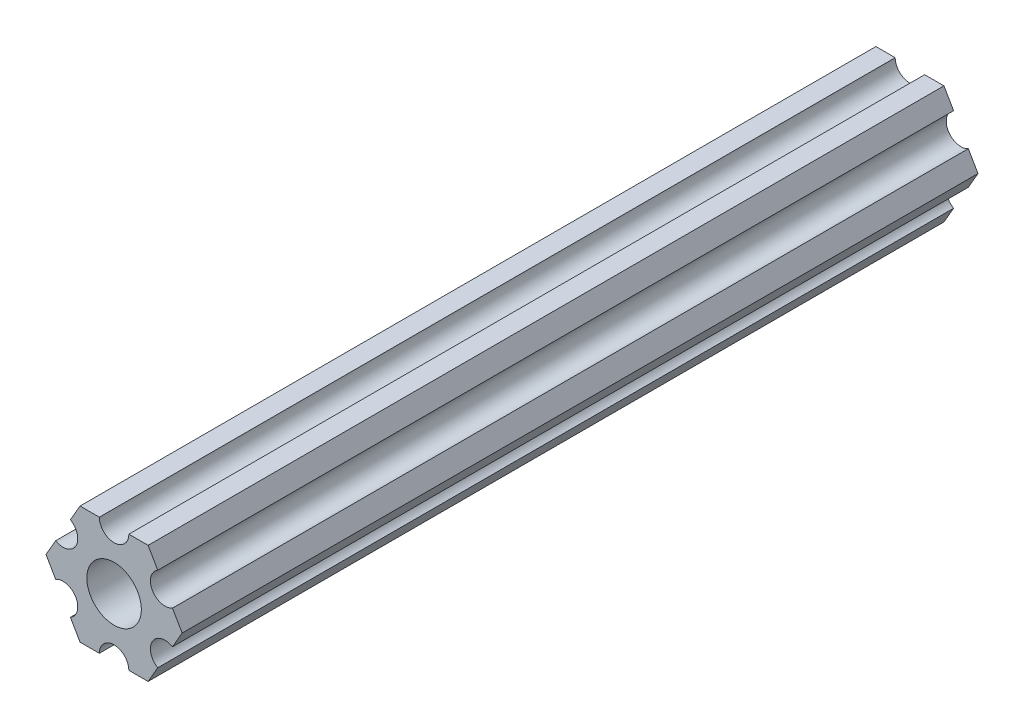
ISO-10303-21;
HEADER;
FILE_DESCRIPTION(('STEP AP214'),'2;1');
FILE_NAME('part.step','',(''),(''),'','','');
FILE_SCHEMA(('AUTOMOTIVE_DESIGN { 1 0 10303 214 1 1 1 1 }'));
ENDSEC;
DATA;
#1=APPLICATION_CONTEXT('core data for automotive mechanical design processes');
#2=APPLICATION_PROTOCOL_DEFINITION('international standard','automotive_design',2000,#1);
#3=PRODUCT_CONTEXT('',#1,'mechanical');
#4=PRODUCT('Part','Part','',(#3));
#5=PRODUCT_RELATED_PRODUCT_CATEGORY('part','',(#4));
#6=PRODUCT_DEFINITION_FORMATION('','',#4);
#7=PRODUCT_DEFINITION_CONTEXT('part definition',#1,'design');
#8=PRODUCT_DEFINITION('design','',#6,#7);
#9=PRODUCT_DEFINITION_SHAPE('','',#8);
#10=(LENGTH_UNIT() NAMED_UNIT(*) SI_UNIT(.MILLI.,.METRE.));
#11=(NAMED_UNIT(*) PLANE_ANGLE_UNIT() SI_UNIT($,.RADIAN.));
#12=(NAMED_UNIT(*) SI_UNIT($,.STERADIAN.) SOLID_ANGLE_UNIT());
#13=UNCERTAINTY_MEASURE_WITH_UNIT(LENGTH_MEASURE(1.E-05),#10,'distance_accuracy_value','');
#14=(GEOMETRIC_REPRESENTATION_CONTEXT(3) GLOBAL_UNCERTAINTY_ASSIGNED_CONTEXT((#13)) GLOBAL_UNIT_ASSIGNED_CONTEXT((#10,
#11,#12)) REPRESENTATION_CONTEXT('',''));
#15=CARTESIAN_POINT('',(0.,0.,0.));
#16=DIRECTION('',(0.,0.,1.));
#17=DIRECTION('',(1.,0.,0.));
#18=AXIS2_PLACEMENT_3D('',#15,#16,#17);
#19=CARTESIAN_POINT('',(6.29301142309098,-1.80018429024546,85.725));
#20=DIRECTION('',(-0.866025434075723,0.499999947533953,0.));
#21=DIRECTION('',(-0.499999947533953,-0.866025434075723,0.));
#22=AXIS2_PLACEMENT_3D('',#19,#20,#21);
#23=PLANE('',#22);
#24=DIRECTION('',(0.,0.,1.));
#25=VECTOR('',#24,1.);
#26=CARTESIAN_POINT('',(7.33234841870826,4.44212519169686E-07,85.725));
#27=LINE('',#26,#25);
#28=CARTESIAN_POINT('',(7.33234841870826,4.44212518961143E-07,0.));
#29=VERTEX_POINT('',#28);
#30=CARTESIAN_POINT('',(7.33234841870826,4.44212519315656E-07,85.725));
#31=VERTEX_POINT('',#30);
#32=EDGE_CURVE('E249',#29,#31,#27,.T.);
#33=ORIENTED_EDGE('',*,*,#32,.T.);
#34=DIRECTION('',(0.499999947533953,0.866025434075723,0.));
#35=VECTOR('',#34,1.);
#36=CARTESIAN_POINT('',(6.29301142309098,-1.80018429024546,85.725));
#37=LINE('',#36,#35);
#38=CARTESIAN_POINT('',(6.29301142309098,-1.80018429024546,85.725));
#39=VERTEX_POINT('',#38);
#40=EDGE_CURVE('E170',#39,#31,#37,.T.);
#41=ORIENTED_EDGE('',*,*,#40,.F.);
#42=DIRECTION('',(0.,0.,-1.));
#43=VECTOR('',#42,1.);
#44=CARTESIAN_POINT('',(6.29301142309098,-1.80018429024546,85.725));
#45=LINE('',#44,#43);
#46=CARTESIAN_POINT('',(6.29301142309098,-1.80018429024546,0.));
#47=VERTEX_POINT('',#46);
#48=EDGE_CURVE('E210',#39,#47,#45,.T.);
#49=ORIENTED_EDGE('',*,*,#48,.T.);
#50=DIRECTION('',(0.499999947533953,0.866025434075723,0.));
#51=VECTOR('',#50,1.);
#52=CARTESIAN_POINT('',(6.29301142309098,-1.80018429024546,0.));
#53=LINE('',#52,#51);
#54=EDGE_CURVE('E172',#47,#29,#53,.T.);
#55=ORIENTED_EDGE('',*,*,#54,.T.);
#56=EDGE_LOOP('',(#33,#41,#49,#55));
#57=FACE_BOUND('',#56,.T.);
#58=ADVANCED_FACE('F14',(#57),#23,.F.);
#59=CARTESIAN_POINT('',(7.33234841870826,4.44212519169686E-07,85.725));
#60=DIRECTION('',(-0.866025373493145,-0.500000052466056,0.));
#61=DIRECTION('',(0.500000052466056,-0.866025373493145,0.));
#62=AXIS2_PLACEMENT_3D('',#59,#60,#61);
#63=PLANE('',#62);
#64=DIRECTION('',(0.,0.,-1.));
#65=VECTOR('',#64,1.);
#66=CARTESIAN_POINT('',(6.29301120497139,1.80018505273895,85.725));
#67=LINE('',#66,#65);
#68=CARTESIAN_POINT('',(6.29301120497139,1.80018505273895,0.));
#69=VERTEX_POINT('',#68);
#70=CARTESIAN_POINT('',(6.29301120497139,1.80018505273895,85.725));
#71=VERTEX_POINT('',#70);
#72=EDGE_CURVE('E247',#69,#71,#67,.F.);
#73=ORIENTED_EDGE('',*,*,#72,.T.);
#74=DIRECTION('',(-0.500000052466056,0.866025373493145,0.));
#75=VECTOR('',#74,1.);
#76=CARTESIAN_POINT('',(7.33234841870826,4.44212519198905E-07,85.725));
#77=LINE('',#76,#75);
#78=EDGE_CURVE('E61',#31,#71,#77,.T.);
#79=ORIENTED_EDGE('',*,*,#78,.F.);
#80=ORIENTED_EDGE('',*,*,#32,.F.);
#81=DIRECTION('',(-0.500000052466056,0.866025373493145,0.));
#82=VECTOR('',#81,1.);
#83=CARTESIAN_POINT('',(7.33234841870826,4.44212519198905E-07,0.));
#84=LINE('',#83,#82);
#85=EDGE_CURVE('E207',#29,#69,#84,.T.);
#86=ORIENTED_EDGE('',*,*,#85,.T.);
#87=EDGE_LOOP('',(#73,#79,#80,#86));
#88=FACE_BOUND('',#87,.T.);
#89=ADVANCED_FACE('F294',(#88),#63,.F.);
#90=CARTESIAN_POINT('',(5.49926112168156,3.17500033315933,85.725));
#91=DIRECTION('',(0.,0.,-1.));
#92=DIRECTION('',(-1.,0.,0.));
#93=AXIS2_PLACEMENT_3D('',#90,#91,#92);
#94=CYLINDRICAL_SURFACE('',#93,1.5875);
#95=CARTESIAN_POINT('',(5.49926112168156,3.17500033315933,85.725));
#96=DIRECTION('',(0.,0.,-1.));
#97=DIRECTION('',(-1.,0.,0.));
#98=AXIS2_PLACEMENT_3D('',#95,#96,#97);
#99=CIRCLE('',#98,1.5875);
#100=CARTESIAN_POINT('',(4.70551103839172,4.54981561357972,85.725));
#101=VERTEX_POINT('',#100);
#102=EDGE_CURVE('E53',#71,#101,#99,.T.);
#103=ORIENTED_EDGE('',*,*,#102,.F.);
#104=ORIENTED_EDGE('',*,*,#72,.F.);
#105=CARTESIAN_POINT('',(5.49926112168156,3.17500033315933,0.));
#106=DIRECTION('',(0.,0.,-1.));
#107=DIRECTION('',(-1.,0.,0.));
#108=AXIS2_PLACEMENT_3D('',#105,#106,#107);
#109=CIRCLE('',#108,1.5875);
#110=CARTESIAN_POINT('',(4.70551103839172,4.54981561357972,0.));
#111=VERTEX_POINT('',#110);
#112=EDGE_CURVE('E17',#69,#111,#109,.T.);
#113=ORIENTED_EDGE('',*,*,#112,.T.);
#114=DIRECTION('',(0.,0.,1.));
#115=VECTOR('',#114,1.);
#116=CARTESIAN_POINT('',(4.70551103839172,4.54981561357972,85.725));
#117=LINE('',#116,#115);
#118=EDGE_CURVE('E245',#111,#101,#117,.T.);
#119=ORIENTED_EDGE('',*,*,#118,.T.);
#120=EDGE_LOOP('',(#103,#104,#113,#119));
#121=FACE_BOUND('',#120,.T.);
#122=ADVANCED_FACE('F292',(#121),#94,.F.);
#123=CARTESIAN_POINT('',(4.70551103839172,4.54981561357972,85.725));
#124=DIRECTION('',(-0.866025373493151,-0.500000052466046,0.));
#125=DIRECTION('',(0.500000052466046,-0.866025373493151,0.));
#126=AXIS2_PLACEMENT_3D('',#123,#124,#125);
#127=PLANE('',#126);
#128=DIRECTION('',(0.,0.,1.));
#129=VECTOR('',#128,1.);
#130=CARTESIAN_POINT('',(3.66617382465481,6.35000022210627,85.725));
#131=LINE('',#130,#129);
#132=CARTESIAN_POINT('',(3.66617382465481,6.35000022210627,0.));
#133=VERTEX_POINT('',#132);
#134=CARTESIAN_POINT('',(3.66617382465481,6.35000022210627,85.725));
#135=VERTEX_POINT('',#134);
#136=EDGE_CURVE('E242',#133,#135,#131,.T.);
#137=ORIENTED_EDGE('',*,*,#136,.T.);
#138=DIRECTION('',(-0.500000052466046,0.866025373493151,0.));
#139=VECTOR('',#138,1.);
#140=CARTESIAN_POINT('',(4.70551103839172,4.54981561357972,85.725));
#141=LINE('',#140,#139);
#142=EDGE_CURVE('E167',#101,#135,#141,.T.);
#143=ORIENTED_EDGE('',*,*,#142,.F.);
#144=ORIENTED_EDGE('',*,*,#118,.F.);
#145=DIRECTION('',(-0.500000052466046,0.866025373493151,0.));
#146=VECTOR('',#145,1.);
#147=CARTESIAN_POINT('',(4.70551103839172,4.54981561357972,0.));
#148=LINE('',#147,#146);
#149=EDGE_CURVE('E204',#111,#133,#148,.T.);
#150=ORIENTED_EDGE('',*,*,#149,.T.);
#151=EDGE_LOOP('',(#137,#143,#144,#150));
#152=FACE_BOUND('',#151,.T.);
#153=ADVANCED_FACE('F285',(#152),#127,.F.);
#154=CARTESIAN_POINT('',(3.66617382465481,6.35000022210627,85.725));
#155=DIRECTION('',(6.05825850611185E-08,-0.999999999999998,0.));
#156=DIRECTION('',(0.999999999999998,6.05825850611185E-08,0.));
#157=AXIS2_PLACEMENT_3D('',#154,#155,#156);
#158=PLANE('',#157);
#159=DIRECTION('',(0.,0.,-1.));
#160=VECTOR('',#159,1.);
#161=CARTESIAN_POINT('',(1.58749961530074,6.35000009617482,85.725));
#162=LINE('',#161,#160);
#163=CARTESIAN_POINT('',(1.58749961530073,6.35000015914054,0.));
#164=VERTEX_POINT('',#163);
#165=CARTESIAN_POINT('',(1.58749961530073,6.35000015914054,85.725));
#166=VERTEX_POINT('',#165);
#167=EDGE_CURVE('E240',#164,#166,#162,.F.);
#168=ORIENTED_EDGE('',*,*,#167,.T.);
#169=DIRECTION('',(1.,0.,0.));
#170=VECTOR('',#169,1.);
#171=CARTESIAN_POINT('',(5.49926112168156,6.35000022210627,85.725));
#172=LINE('',#171,#170);
#173=EDGE_CURVE('E142',#135,#166,#172,.F.);
#174=ORIENTED_EDGE('',*,*,#173,.F.);
#175=ORIENTED_EDGE('',*,*,#136,.F.);
#176=DIRECTION('',(1.,0.,0.));
#177=VECTOR('',#176,1.);
#178=CARTESIAN_POINT('',(5.49926112168156,6.35000022210627,0.));
#179=LINE('',#178,#177);
#180=EDGE_CURVE('E201',#133,#164,#179,.F.);
#181=ORIENTED_EDGE('',*,*,#180,.T.);
#182=EDGE_LOOP('',(#168,#174,#175,#181));
#183=FACE_BOUND('',#182,.T.);
#184=ADVANCED_FACE('F282',(#183),#158,.F.);
#185=CARTESIAN_POINT('',(-3.84699260060323E-07,6.35,85.725));
#186=DIRECTION('',(0.,0.,-1.));
#187=DIRECTION('',(-1.,0.,0.));
#188=AXIS2_PLACEMENT_3D('',#185,#186,#187);
#189=CYLINDRICAL_SURFACE('',#188,1.5875);
#190=DIRECTION('',(0.,0.,1.));
#191=VECTOR('',#190,1.);
#192=CARTESIAN_POINT('',(-1.58750038469926,6.34999990382518,85.725));
#193=LINE('',#192,#191);
#194=CARTESIAN_POINT('',(-1.58750038469926,6.34999990382518,0.));
#195=VERTEX_POINT('',#194);
#196=CARTESIAN_POINT('',(-1.58750038469926,6.34999990382518,85.725));
#197=VERTEX_POINT('',#196);
#198=EDGE_CURVE('E101',#195,#197,#193,.T.);
#199=ORIENTED_EDGE('',*,*,#198,.T.);
#200=CARTESIAN_POINT('',(-3.84699260060323E-07,6.35,85.725));
#201=DIRECTION('',(0.,0.,-1.));
#202=DIRECTION('',(-1.,0.,0.));
#203=AXIS2_PLACEMENT_3D('',#200,#201,#202);
#204=CIRCLE('',#203,1.5875);
#205=EDGE_CURVE('E146',#166,#197,#204,.T.);
#206=ORIENTED_EDGE('',*,*,#205,.F.);
#207=ORIENTED_EDGE('',*,*,#167,.F.);
#208=CARTESIAN_POINT('',(-3.84699260060323E-07,6.35,0.));
#209=DIRECTION('',(0.,0.,-1.));
#210=DIRECTION('',(-1.,0.,0.));
#211=AXIS2_PLACEMENT_3D('',#208,#209,#210);
#212=CIRCLE('',#211,1.5875);
#213=EDGE_CURVE('E200',#164,#195,#212,.T.);
#214=ORIENTED_EDGE('',*,*,#213,.T.);
#215=EDGE_LOOP('',(#199,#206,#207,#214));
#216=FACE_BOUND('',#215,.T.);
#217=ADVANCED_FACE('F276',(#216),#189,.F.);
#218=CARTESIAN_POINT('',(-1.58750038469926,6.34999990382518,85.725));
#219=DIRECTION('',(6.05825963273174E-08,-0.999999999999998,0.));
#220=DIRECTION('',(0.999999999999998,6.05825963273174E-08,0.));
#221=AXIS2_PLACEMENT_3D('',#218,#219,#220);
#222=PLANE('',#221);
#223=DIRECTION('',(0.,0.,1.));
#224=VECTOR('',#223,1.);
#225=CARTESIAN_POINT('',(-3.66617459405349,6.3499997778937,85.725));
#226=LINE('',#225,#224);
#227=CARTESIAN_POINT('',(-3.66617454558244,6.34999986184803,0.));
#228=VERTEX_POINT('',#227);
#229=CARTESIAN_POINT('',(-3.66617454558244,6.34999986184803,85.725));
#230=VERTEX_POINT('',#229);
#231=EDGE_CURVE('E109',#228,#230,#226,.T.);
#232=ORIENTED_EDGE('',*,*,#231,.T.);
#233=DIRECTION('',(1.,0.,0.));
#234=VECTOR('',#233,1.);
#235=CARTESIAN_POINT('',(5.49926112168156,6.34999990382518,85.725));
#236=LINE('',#235,#234);
#237=EDGE_CURVE('E147',#197,#230,#236,.F.);
#238=ORIENTED_EDGE('',*,*,#237,.F.);
#239=ORIENTED_EDGE('',*,*,#198,.F.);
#240=DIRECTION('',(1.,0.,0.));
#241=VECTOR('',#240,1.);
#242=CARTESIAN_POINT('',(5.49926112168156,6.34999990382518,0.));
#243=LINE('',#242,#241);
#244=EDGE_CURVE('E154',#195,#228,#243,.F.);
#245=ORIENTED_EDGE('',*,*,#244,.T.);
#246=EDGE_LOOP('',(#232,#238,#239,#245));
#247=FACE_BOUND('',#246,.T.);
#248=ADVANCED_FACE('F153',(#247),#222,.F.);
#249=CARTESIAN_POINT('',(-3.66617459405349,6.3499997778937,85.725));
#250=DIRECTION('',(0.866025434075729,-0.499999947533942,0.));
#251=DIRECTION('',(0.499999947533942,0.866025434075729,0.));
#252=AXIS2_PLACEMENT_3D('',#249,#250,#251);
#253=PLANE('',#252);
#254=DIRECTION('',(0.,0.,-1.));
#255=VECTOR('',#254,1.);
#256=CARTESIAN_POINT('',(-4.70551158967065,4.54981504343587,85.725));
#257=LINE('',#256,#255);
#258=CARTESIAN_POINT('',(-4.70551158967065,4.54981504343587,0.));
#259=VERTEX_POINT('',#258);
#260=CARTESIAN_POINT('',(-4.70551158967065,4.54981504343587,85.725));
#261=VERTEX_POINT('',#260);
#262=EDGE_CURVE('E155',#259,#261,#257,.F.);
#263=ORIENTED_EDGE('',*,*,#262,.T.);
#264=DIRECTION('',(-0.499999947533943,-0.866025434075729,0.));
#265=VECTOR('',#264,1.);
#266=CARTESIAN_POINT('',(-3.66617459405349,6.3499997778937,85.725));
#267=LINE('',#266,#265);
#268=EDGE_CURVE('E150',#230,#261,#267,.T.);
#269=ORIENTED_EDGE('',*,*,#268,.F.);
#270=ORIENTED_EDGE('',*,*,#231,.F.);
#271=DIRECTION('',(-0.499999947533943,-0.866025434075729,0.));
#272=VECTOR('',#271,1.);
#273=CARTESIAN_POINT('',(-3.66617459405349,6.3499997778937,0.));
#274=LINE('',#273,#272);
#275=EDGE_CURVE('E197',#228,#259,#274,.T.);
#276=ORIENTED_EDGE('',*,*,#275,.T.);
#277=EDGE_LOOP('',(#263,#269,#270,#276));
#278=FACE_BOUND('',#277,.T.);
#279=ADVANCED_FACE('F157',(#278),#253,.F.);
#280=CARTESIAN_POINT('',(-5.49926150638082,3.17499966684067,85.725));
#281=DIRECTION('',(0.,0.,-1.));
#282=DIRECTION('',(-1.,0.,0.));
#283=AXIS2_PLACEMENT_3D('',#280,#281,#282);
#284=CYLINDRICAL_SURFACE('',#283,1.5875);
#285=DIRECTION('',(0.,0.,1.));
#286=VECTOR('',#285,1.);
#287=CARTESIAN_POINT('',(-6.29301142309098,1.80018429024547,85.725));
#288=LINE('',#287,#286);
#289=CARTESIAN_POINT('',(-6.29301142309098,1.80018429024547,0.));
#290=VERTEX_POINT('',#289);
#291=CARTESIAN_POINT('',(-6.29301142309098,1.80018429024547,85.725));
#292=VERTEX_POINT('',#291);
#293=EDGE_CURVE('E235',#290,#292,#288,.T.);
#294=ORIENTED_EDGE('',*,*,#293,.T.);
#295=CARTESIAN_POINT('',(-5.49926150638082,3.17499966684067,85.725));
#296=DIRECTION('',(0.,0.,-1.));
#297=DIRECTION('',(-1.,0.,0.));
#298=AXIS2_PLACEMENT_3D('',#295,#296,#297);
#299=CIRCLE('',#298,1.5875);
#300=EDGE_CURVE('E159',#261,#292,#299,.T.);
#301=ORIENTED_EDGE('',*,*,#300,.F.);
#302=ORIENTED_EDGE('',*,*,#262,.F.);
#303=CARTESIAN_POINT('',(-5.49926150638082,3.17499966684067,0.));
#304=DIRECTION('',(0.,0.,-1.));
#305=DIRECTION('',(-1.,0.,0.));
#306=AXIS2_PLACEMENT_3D('',#303,#304,#305);
#307=CIRCLE('',#306,1.5875);
#308=EDGE_CURVE('E196',#259,#290,#307,.T.);
#309=ORIENTED_EDGE('',*,*,#308,.T.);
#310=EDGE_LOOP('',(#294,#301,#302,#309));
#311=FACE_BOUND('',#310,.T.);
#312=ADVANCED_FACE('F346',(#311),#284,.F.);
#313=CARTESIAN_POINT('',(-6.29301142309098,1.80018429024547,85.725));
#314=DIRECTION('',(0.866025434075724,-0.499999947533951,0.));
#315=DIRECTION('',(0.499999947533951,0.866025434075724,0.));
#316=AXIS2_PLACEMENT_3D('',#313,#314,#315);
#317=PLANE('',#316);
#318=DIRECTION('',(0.,0.,1.));
#319=VECTOR('',#318,1.);
#320=CARTESIAN_POINT('',(-7.33234841870826,-4.44212523790841E-07,85.725));
#321=LINE('',#320,#319);
#322=CARTESIAN_POINT('',(-7.33234841870826,-4.44212524036367E-07,0.));
#323=VERTEX_POINT('',#322);
#324=CARTESIAN_POINT('',(-7.33234841870826,-4.44212524036367E-07,85.725));
#325=VERTEX_POINT('',#324);
#326=EDGE_CURVE('E232',#323,#325,#321,.T.);
#327=ORIENTED_EDGE('',*,*,#326,.T.);
#328=DIRECTION('',(-0.499999947533952,-0.866025434075724,0.));
#329=VECTOR('',#328,1.);
#330=CARTESIAN_POINT('',(-6.29301142309098,1.80018429024547,85.725));
#331=LINE('',#330,#329);
#332=EDGE_CURVE('E161',#292,#325,#331,.T.);
#333=ORIENTED_EDGE('',*,*,#332,.F.);
#334=ORIENTED_EDGE('',*,*,#293,.F.);
#335=DIRECTION('',(-0.499999947533952,-0.866025434075724,0.));
#336=VECTOR('',#335,1.);
#337=CARTESIAN_POINT('',(-6.29301142309098,1.80018429024547,0.));
#338=LINE('',#337,#336);
#339=EDGE_CURVE('E193',#290,#323,#338,.T.);
#340=ORIENTED_EDGE('',*,*,#339,.T.);
#341=EDGE_LOOP('',(#327,#333,#334,#340));
#342=FACE_BOUND('',#341,.T.);
#343=ADVANCED_FACE('F314',(#342),#317,.F.);
#344=CARTESIAN_POINT('',(-7.33234841870826,-4.44212523790841E-07,85.725));
#345=DIRECTION('',(0.866025373493151,0.500000052466045,0.));
#346=DIRECTION('',(-0.500000052466045,0.866025373493151,0.));
#347=AXIS2_PLACEMENT_3D('',#344,#345,#346);
#348=PLANE('',#347);
#349=DIRECTION('',(0.,0.,-1.));
#350=VECTOR('',#349,1.);
#351=CARTESIAN_POINT('',(-6.29301120497141,-1.80018505273896,85.725));
#352=LINE('',#351,#350);
#353=CARTESIAN_POINT('',(-6.29301120497141,-1.80018505273896,0.));
#354=VERTEX_POINT('',#353);
#355=CARTESIAN_POINT('',(-6.29301120497141,-1.80018505273896,85.725));
#356=VERTEX_POINT('',#355);
#357=EDGE_CURVE('E229',#354,#356,#352,.F.);
#358=ORIENTED_EDGE('',*,*,#357,.T.);
#359=DIRECTION('',(0.500000052466045,-0.866025373493151,0.));
#360=VECTOR('',#359,1.);
#361=CARTESIAN_POINT('',(-7.33234841870826,-4.44212523969395E-07,85.725));
#362=LINE('',#361,#360);
#363=EDGE_CURVE('E262',#325,#356,#362,.T.);
#364=ORIENTED_EDGE('',*,*,#363,.F.);
#365=ORIENTED_EDGE('',*,*,#326,.F.);
#366=DIRECTION('',(0.500000052466045,-0.866025373493151,0.));
#367=VECTOR('',#366,1.);
#368=CARTESIAN_POINT('',(-7.33234841870826,-4.44212523969395E-07,0.));
#369=LINE('',#368,#367);
#370=EDGE_CURVE('E190',#323,#354,#369,.T.);
#371=ORIENTED_EDGE('',*,*,#370,.T.);
#372=EDGE_LOOP('',(#358,#364,#365,#371));
#373=FACE_BOUND('',#372,.T.);
#374=ADVANCED_FACE('F318',(#373),#348,.F.);
#375=CARTESIAN_POINT('',(-5.49926112168156,-3.17500033315934,85.725));
#376=DIRECTION('',(0.,0.,-1.));
#377=DIRECTION('',(-1.,0.,0.));
#378=AXIS2_PLACEMENT_3D('',#375,#376,#377);
#379=CYLINDRICAL_SURFACE('',#378,1.5875);
#380=DIRECTION('',(0.,0.,1.));
#381=VECTOR('',#380,1.);
#382=CARTESIAN_POINT('',(-4.70551103839172,-4.54981561357972,85.725));
#383=LINE('',#382,#381);
#384=CARTESIAN_POINT('',(-4.70551103839172,-4.54981561357972,0.));
#385=VERTEX_POINT('',#384);
#386=CARTESIAN_POINT('',(-4.70551103839172,-4.54981561357972,85.725));
#387=VERTEX_POINT('',#386);
#388=EDGE_CURVE('E226',#385,#387,#383,.T.);
#389=ORIENTED_EDGE('',*,*,#388,.T.);
#390=CARTESIAN_POINT('',(-5.49926112168156,-3.17500033315934,85.725));
#391=DIRECTION('',(0.,0.,-1.));
#392=DIRECTION('',(-1.,0.,0.));
#393=AXIS2_PLACEMENT_3D('',#390,#391,#392);
#394=CIRCLE('',#393,1.5875);
#395=EDGE_CURVE('E260',#356,#387,#394,.T.);
#396=ORIENTED_EDGE('',*,*,#395,.F.);
#397=ORIENTED_EDGE('',*,*,#357,.F.);
#398=CARTESIAN_POINT('',(-5.49926112168156,-3.17500033315934,0.));
#399=DIRECTION('',(0.,0.,-1.));
#400=DIRECTION('',(-1.,0.,0.));
#401=AXIS2_PLACEMENT_3D('',#398,#399,#400);
#402=CIRCLE('',#401,1.5875);
#403=EDGE_CURVE('E189',#354,#385,#402,.T.);
#404=ORIENTED_EDGE('',*,*,#403,.T.);
#405=EDGE_LOOP('',(#389,#396,#397,#404));
#406=FACE_BOUND('',#405,.T.);
#407=ADVANCED_FACE('F322',(#406),#379,.F.);
#408=CARTESIAN_POINT('',(-4.70551103839172,-4.54981561357972,85.725));
#409=DIRECTION('',(0.866025373493151,0.500000052466045,0.));
#410=DIRECTION('',(-0.500000052466045,0.866025373493151,0.));
#411=AXIS2_PLACEMENT_3D('',#408,#409,#410);
#412=PLANE('',#411);
#413=DIRECTION('',(0.,0.,1.));
#414=VECTOR('',#413,1.);
#415=CARTESIAN_POINT('',(-3.66617382465481,-6.35000022210628,85.725));
#416=LINE('',#415,#414);
#417=CARTESIAN_POINT('',(-3.6661738246548,-6.35000022210628,0.));
#418=VERTEX_POINT('',#417);
#419=CARTESIAN_POINT('',(-3.6661738246548,-6.35000022210628,85.725));
#420=VERTEX_POINT('',#419);
#421=EDGE_CURVE('E223',#418,#420,#416,.T.);
#422=ORIENTED_EDGE('',*,*,#421,.T.);
#423=DIRECTION('',(0.500000052466045,-0.866025373493151,0.));
#424=VECTOR('',#423,1.);
#425=CARTESIAN_POINT('',(-4.70551103839172,-4.54981561357972,85.725));
#426=LINE('',#425,#424);
#427=EDGE_CURVE('E261',#387,#420,#426,.T.);
#428=ORIENTED_EDGE('',*,*,#427,.F.);
#429=ORIENTED_EDGE('',*,*,#388,.F.);
#430=DIRECTION('',(0.500000052466045,-0.866025373493151,0.));
#431=VECTOR('',#430,1.);
#432=CARTESIAN_POINT('',(-4.70551103839172,-4.54981561357972,0.));
#433=LINE('',#432,#431);
#434=EDGE_CURVE('E186',#385,#418,#433,.T.);
#435=ORIENTED_EDGE('',*,*,#434,.T.);
#436=EDGE_LOOP('',(#422,#428,#429,#435));
#437=FACE_BOUND('',#436,.T.);
#438=ADVANCED_FACE('F328',(#437),#412,.F.);
#439=CARTESIAN_POINT('',(-3.66617382465481,-6.35000022210628,85.725));
#440=DIRECTION('',(-6.05825854783851E-08,0.999999999999998,0.));
#441=DIRECTION('',(-0.999999999999998,-6.05825854783851E-08,0.));
#442=AXIS2_PLACEMENT_3D('',#439,#440,#441);
#443=PLANE('',#442);
#444=DIRECTION('',(0.,0.,-1.));
#445=VECTOR('',#444,1.);
#446=CARTESIAN_POINT('',(-1.58749961530074,-6.35,85.725));
#447=LINE('',#446,#445);
#448=CARTESIAN_POINT('',(-1.58749961530073,-6.35000011105314,0.));
#449=VERTEX_POINT('',#448);
#450=CARTESIAN_POINT('',(-1.58749961530073,-6.35000011105314,85.725));
#451=VERTEX_POINT('',#450);
#452=EDGE_CURVE('E220',#449,#451,#447,.F.);
#453=ORIENTED_EDGE('',*,*,#452,.T.);
#454=DIRECTION('',(1.,0.,0.));
#455=VECTOR('',#454,1.);
#456=CARTESIAN_POINT('',(5.49926112168156,-6.35000022210628,85.725));
#457=LINE('',#456,#455);
#458=EDGE_CURVE('E259',#420,#451,#457,.T.);
#459=ORIENTED_EDGE('',*,*,#458,.F.);
#460=ORIENTED_EDGE('',*,*,#421,.F.);
#461=DIRECTION('',(1.,0.,0.));
#462=VECTOR('',#461,1.);
#463=CARTESIAN_POINT('',(5.49926112168156,-6.35000022210628,0.));
#464=LINE('',#463,#462);
#465=EDGE_CURVE('E183',#418,#449,#464,.T.);
#466=ORIENTED_EDGE('',*,*,#465,.T.);
#467=EDGE_LOOP('',(#453,#459,#460,#466));
#468=FACE_BOUND('',#467,.T.);
#469=ADVANCED_FACE('F332',(#468),#443,.F.);
#470=CARTESIAN_POINT('',(3.8469926204343E-07,-6.35,85.725));
#471=DIRECTION('',(0.,0.,-1.));
#472=DIRECTION('',(-1.,0.,0.));
#473=AXIS2_PLACEMENT_3D('',#470,#471,#472);
#474=CYLINDRICAL_SURFACE('',#473,1.5875);
#475=DIRECTION('',(0.,0.,1.));
#476=VECTOR('',#475,1.);
#477=CARTESIAN_POINT('',(1.58750038469926,-6.34999990382518,85.725));
#478=LINE('',#477,#476);
#479=CARTESIAN_POINT('',(1.58750038469926,-6.34999990382518,0.));
#480=VERTEX_POINT('',#479);
#481=CARTESIAN_POINT('',(1.58750038469926,-6.34999990382518,85.725));
#482=VERTEX_POINT('',#481);
#483=EDGE_CURVE('E217',#480,#482,#478,.T.);
#484=ORIENTED_EDGE('',*,*,#483,.T.);
#485=CARTESIAN_POINT('',(3.8469926204343E-07,-6.35,85.725));
#486=DIRECTION('',(0.,0.,-1.));
#487=DIRECTION('',(-1.,0.,0.));
#488=AXIS2_PLACEMENT_3D('',#485,#486,#487);
#489=CIRCLE('',#488,1.5875);
#490=EDGE_CURVE('E256',#451,#482,#489,.T.);
#491=ORIENTED_EDGE('',*,*,#490,.F.);
#492=ORIENTED_EDGE('',*,*,#452,.F.);
#493=CARTESIAN_POINT('',(3.8469926204343E-07,-6.35,0.));
#494=DIRECTION('',(0.,0.,-1.));
#495=DIRECTION('',(-1.,0.,0.));
#496=AXIS2_PLACEMENT_3D('',#493,#494,#495);
#497=CIRCLE('',#496,1.5875);
#498=EDGE_CURVE('E182',#449,#480,#497,.T.);
#499=ORIENTED_EDGE('',*,*,#498,.T.);
#500=EDGE_LOOP('',(#484,#491,#492,#499));
#501=FACE_BOUND('',#500,.T.);
#502=ADVANCED_FACE('F336',(#501),#474,.F.);
#503=CARTESIAN_POINT('',(1.58750038469926,-6.34999990382518,85.725));
#504=DIRECTION('',(-6.05825721258438E-08,0.999999999999998,0.));
#505=DIRECTION('',(-0.999999999999998,-6.05825721258438E-08,0.));
#506=AXIS2_PLACEMENT_3D('',#503,#504,#505);
#507=PLANE('',#506);
#508=DIRECTION('',(0.,0.,1.));
#509=VECTOR('',#508,1.);
#510=CARTESIAN_POINT('',(3.66617459405346,-6.34999977789375,85.725));
#511=LINE('',#510,#509);
#512=CARTESIAN_POINT('',(3.66617454558244,-6.34999986184804,0.));
#513=VERTEX_POINT('',#512);
#514=CARTESIAN_POINT('',(3.66617454558244,-6.34999986184804,85.725));
#515=VERTEX_POINT('',#514);
#516=EDGE_CURVE('E214',#513,#515,#511,.T.);
#517=ORIENTED_EDGE('',*,*,#516,.T.);
#518=DIRECTION('',(1.,0.,0.));
#519=VECTOR('',#518,1.);
#520=CARTESIAN_POINT('',(5.49926112168156,-6.34999990382518,85.725));
#521=LINE('',#520,#519);
#522=EDGE_CURVE('E258',#482,#515,#521,.T.);
#523=ORIENTED_EDGE('',*,*,#522,.F.);
#524=ORIENTED_EDGE('',*,*,#483,.F.);
#525=DIRECTION('',(1.,0.,0.));
#526=VECTOR('',#525,1.);
#527=CARTESIAN_POINT('',(5.49926112168156,-6.34999990382518,0.));
#528=LINE('',#527,#526);
#529=EDGE_CURVE('E179',#480,#513,#528,.T.);
#530=ORIENTED_EDGE('',*,*,#529,.T.);
#531=EDGE_LOOP('',(#517,#523,#524,#530));
#532=FACE_BOUND('',#531,.T.);
#533=ADVANCED_FACE('F339',(#532),#507,.F.);
#534=CARTESIAN_POINT('',(3.66617459405346,-6.34999977789375,85.725));
#535=DIRECTION('',(-0.86602543407573,0.499999947533941,0.));
#536=DIRECTION('',(-0.499999947533941,-0.86602543407573,0.));
#537=AXIS2_PLACEMENT_3D('',#534,#535,#536);
#538=PLANE('',#537);
#539=DIRECTION('',(0.,0.,1.));
#540=VECTOR('',#539,1.);
#541=CARTESIAN_POINT('',(4.70551158967065,-4.54981504343587,85.725));
#542=LINE('',#541,#540);
#543=CARTESIAN_POINT('',(4.70551158967065,-4.54981504343587,85.725));
#544=VERTEX_POINT('',#543);
#545=CARTESIAN_POINT('',(4.70551158967065,-4.54981504343587,0.));
#546=VERTEX_POINT('',#545);
#547=EDGE_CURVE('E212',#544,#546,#542,.F.);
#548=ORIENTED_EDGE('',*,*,#547,.F.);
#549=DIRECTION('',(0.49999994753394,0.86602543407573,0.));
#550=VECTOR('',#549,1.);
#551=CARTESIAN_POINT('',(3.66617459405346,-6.34999977789376,85.725));
#552=LINE('',#551,#550);
#553=EDGE_CURVE('E255',#515,#544,#552,.T.);
#554=ORIENTED_EDGE('',*,*,#553,.F.);
#555=ORIENTED_EDGE('',*,*,#516,.F.);
#556=DIRECTION('',(0.49999994753394,0.86602543407573,0.));
#557=VECTOR('',#556,1.);
#558=CARTESIAN_POINT('',(3.66617459405346,-6.34999977789376,0.));
#559=LINE('',#558,#557);
#560=EDGE_CURVE('E176',#513,#546,#559,.T.);
#561=ORIENTED_EDGE('',*,*,#560,.T.);
#562=EDGE_LOOP('',(#548,#554,#555,#561));
#563=FACE_BOUND('',#562,.T.);
#564=ADVANCED_FACE('F341',(#563),#538,.F.);
#565=CARTESIAN_POINT('',(5.49926150638082,-3.17499966684067,85.725));
#566=DIRECTION('',(0.,0.,-1.));
#567=DIRECTION('',(-1.,0.,0.));
#568=AXIS2_PLACEMENT_3D('',#565,#566,#567);
#569=CYLINDRICAL_SURFACE('',#568,1.58750000000001);
#570=CARTESIAN_POINT('',(5.49926150638082,-3.17499966684067,85.725));
#571=DIRECTION('',(0.,0.,-1.));
#572=DIRECTION('',(-1.,0.,0.));
#573=AXIS2_PLACEMENT_3D('',#570,#571,#572);
#574=CIRCLE('',#573,1.58750000000001);
#575=EDGE_CURVE('E32',#544,#39,#574,.T.);
#576=ORIENTED_EDGE('',*,*,#575,.F.);
#577=ORIENTED_EDGE('',*,*,#547,.T.);
#578=CARTESIAN_POINT('',(5.49926150638082,-3.17499966684067,0.));
#579=DIRECTION('',(0.,0.,-1.));
#580=DIRECTION('',(-1.,0.,0.));
#581=AXIS2_PLACEMENT_3D('',#578,#579,#580);
#582=CIRCLE('',#581,1.58750000000001);
#583=EDGE_CURVE('E175',#546,#47,#582,.T.);
#584=ORIENTED_EDGE('',*,*,#583,.T.);
#585=ORIENTED_EDGE('',*,*,#48,.F.);
#586=EDGE_LOOP('',(#576,#577,#584,#585));
#587=FACE_BOUND('',#586,.T.);
#588=ADVANCED_FACE('F298',(#587),#569,.F.);
#589=CARTESIAN_POINT('',(5.49926112168156,3.17500033315933,0.));
#590=DIRECTION('',(0.,0.,1.));
#591=DIRECTION('',(1.,0.,0.));
#592=AXIS2_PLACEMENT_3D('',#589,#590,#591);
#593=PLANE('',#592);
#594=CARTESIAN_POINT('',(0.,0.,0.));
#595=DIRECTION('',(0.,0.,-1.));
#596=DIRECTION('',(-1.,0.,0.));
#597=AXIS2_PLACEMENT_3D('',#594,#595,#596);
#598=CIRCLE('',#597,2.9337);
#599=CARTESIAN_POINT('',(-2.9337,0.,0.));
#600=VERTEX_POINT('',#599);
#601=EDGE_CURVE('E23',#600,#600,#598,.F.);
#602=ORIENTED_EDGE('',*,*,#601,.T.);
#603=EDGE_LOOP('',(#602));
#604=FACE_BOUND('',#603,.T.);
#605=ORIENTED_EDGE('',*,*,#583,.F.);
#606=ORIENTED_EDGE('',*,*,#560,.F.);
#607=ORIENTED_EDGE('',*,*,#529,.F.);
#608=ORIENTED_EDGE('',*,*,#498,.F.);
#609=ORIENTED_EDGE('',*,*,#465,.F.);
#610=ORIENTED_EDGE('',*,*,#434,.F.);
#611=ORIENTED_EDGE('',*,*,#403,.F.);
#612=ORIENTED_EDGE('',*,*,#370,.F.);
#613=ORIENTED_EDGE('',*,*,#339,.F.);
#614=ORIENTED_EDGE('',*,*,#308,.F.);
#615=ORIENTED_EDGE('',*,*,#275,.F.);
#616=ORIENTED_EDGE('',*,*,#244,.F.);
#617=ORIENTED_EDGE('',*,*,#213,.F.);
#618=ORIENTED_EDGE('',*,*,#180,.F.);
#619=ORIENTED_EDGE('',*,*,#149,.F.);
#620=ORIENTED_EDGE('',*,*,#112,.F.);
#621=ORIENTED_EDGE('',*,*,#85,.F.);
#622=ORIENTED_EDGE('',*,*,#54,.F.);
#623=EDGE_LOOP('',(#605,#606,#607,#608,#609,#610,#611,#612,#613,#614,#615,#616,#617,#618,#619,
#620,#621,#622));
#624=FACE_BOUND('',#623,.T.);
#625=ADVANCED_FACE('F279',(#604,#624),#593,.F.);
#626=CARTESIAN_POINT('',(5.49926112168156,3.17500033315933,85.725));
#627=DIRECTION('',(0.,0.,1.));
#628=DIRECTION('',(1.,0.,0.));
#629=AXIS2_PLACEMENT_3D('',#626,#627,#628);
#630=PLANE('',#629);
#631=CARTESIAN_POINT('',(0.,0.,85.725));
#632=DIRECTION('',(0.,0.,-1.));
#633=DIRECTION('',(-1.,0.,0.));
#634=AXIS2_PLACEMENT_3D('',#631,#632,#633);
#635=CIRCLE('',#634,2.9337);
#636=CARTESIAN_POINT('',(-2.9337,0.,85.725));
#637=VERTEX_POINT('',#636);
#638=EDGE_CURVE('E9',#637,#637,#635,.T.);
#639=ORIENTED_EDGE('',*,*,#638,.T.);
#640=EDGE_LOOP('',(#639));
#641=FACE_BOUND('',#640,.T.);
#642=ORIENTED_EDGE('',*,*,#553,.T.);
#643=ORIENTED_EDGE('',*,*,#575,.T.);
#644=ORIENTED_EDGE('',*,*,#40,.T.);
#645=ORIENTED_EDGE('',*,*,#78,.T.);
#646=ORIENTED_EDGE('',*,*,#102,.T.);
#647=ORIENTED_EDGE('',*,*,#142,.T.);
#648=ORIENTED_EDGE('',*,*,#173,.T.);
#649=ORIENTED_EDGE('',*,*,#205,.T.);
#650=ORIENTED_EDGE('',*,*,#237,.T.);
#651=ORIENTED_EDGE('',*,*,#268,.T.);
#652=ORIENTED_EDGE('',*,*,#300,.T.);
#653=ORIENTED_EDGE('',*,*,#332,.T.);
#654=ORIENTED_EDGE('',*,*,#363,.T.);
#655=ORIENTED_EDGE('',*,*,#395,.T.);
#656=ORIENTED_EDGE('',*,*,#427,.T.);
#657=ORIENTED_EDGE('',*,*,#458,.T.);
#658=ORIENTED_EDGE('',*,*,#490,.T.);
#659=ORIENTED_EDGE('',*,*,#522,.T.);
#660=EDGE_LOOP('',(#642,#643,#644,#645,#646,#647,#648,#649,#650,#651,#652,#653,#654,#655,#656,
#657,#658,#659));
#661=FACE_BOUND('',#660,.T.);
#662=ADVANCED_FACE('F149',(#641,#661),#630,.T.);
#663=CARTESIAN_POINT('',(0.,0.,85.725));
#664=DIRECTION('',(0.,0.,-1.));
#665=DIRECTION('',(-1.,0.,0.));
#666=AXIS2_PLACEMENT_3D('',#663,#664,#665);
#667=CYLINDRICAL_SURFACE('',#666,2.9337);
#668=ORIENTED_EDGE('',*,*,#601,.F.);
#669=EDGE_LOOP('',(#668));
#670=FACE_BOUND('',#669,.T.);
#671=ORIENTED_EDGE('',*,*,#638,.F.);
#672=EDGE_LOOP('',(#671));
#673=FACE_BOUND('',#672,.T.);
#674=ADVANCED_FACE('F356',(#670,#673),#667,.F.);
#675=CLOSED_SHELL('',(#58,#89,#122,#153,#184,#217,#248,#279,#312,#343,#374,#407,#438,#469,#502,
#533,#564,#588,#625,#662,#674));
#676=MANIFOLD_SOLID_BREP('B1',#675);
#677=ADVANCED_BREP_SHAPE_REPRESENTATION('',(#18,#676),#14);
#678=SHAPE_DEFINITION_REPRESENTATION(#9,#677);
ENDSEC;
END-ISO-10303-21;
